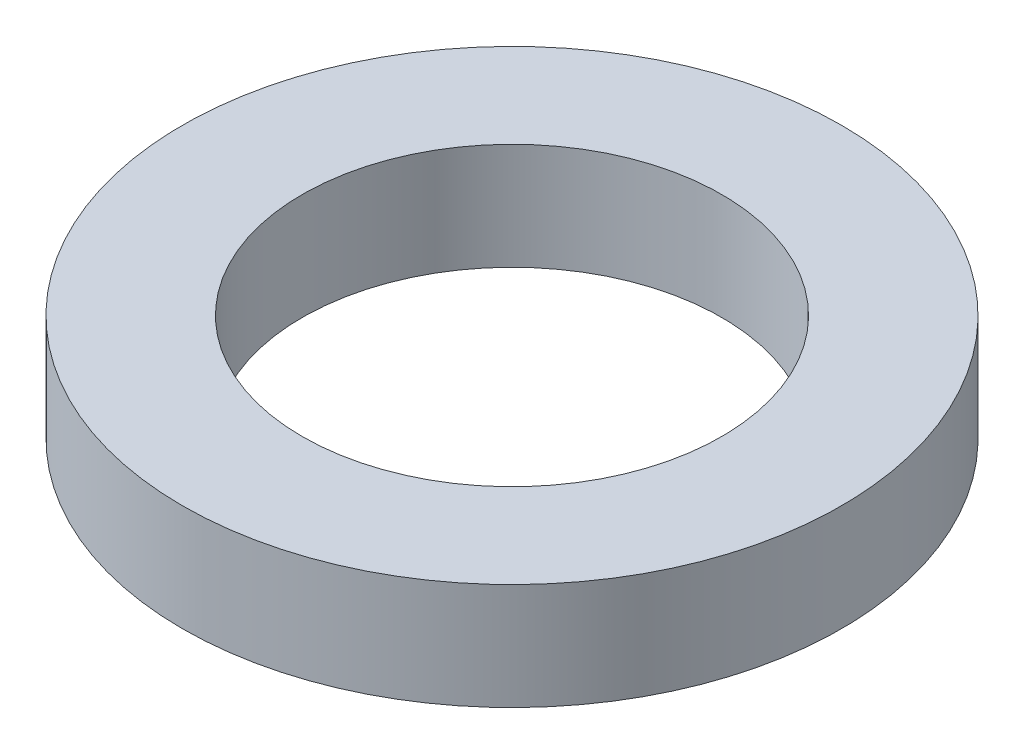
ISO-10303-21;
HEADER;
FILE_DESCRIPTION(('STEP AP214'),'2;1');
FILE_NAME('part.step','',(''),(''),'','','');
FILE_SCHEMA(('AUTOMOTIVE_DESIGN { 1 0 10303 214 1 1 1 1 }'));
ENDSEC;
DATA;
#1=APPLICATION_CONTEXT('core data for automotive mechanical design processes');
#2=APPLICATION_PROTOCOL_DEFINITION('international standard','automotive_design',2000,#1);
#3=PRODUCT_CONTEXT('',#1,'mechanical');
#4=PRODUCT('Part','Part','',(#3));
#5=PRODUCT_RELATED_PRODUCT_CATEGORY('part','',(#4));
#6=PRODUCT_DEFINITION_FORMATION('','',#4);
#7=PRODUCT_DEFINITION_CONTEXT('part definition',#1,'design');
#8=PRODUCT_DEFINITION('design','',#6,#7);
#9=PRODUCT_DEFINITION_SHAPE('','',#8);
#10=(LENGTH_UNIT() NAMED_UNIT(*) SI_UNIT(.MILLI.,.METRE.));
#11=(NAMED_UNIT(*) PLANE_ANGLE_UNIT() SI_UNIT($,.RADIAN.));
#12=(NAMED_UNIT(*) SI_UNIT($,.STERADIAN.) SOLID_ANGLE_UNIT());
#13=UNCERTAINTY_MEASURE_WITH_UNIT(LENGTH_MEASURE(1.E-05),#10,'distance_accuracy_value','');
#14=(GEOMETRIC_REPRESENTATION_CONTEXT(3) GLOBAL_UNCERTAINTY_ASSIGNED_CONTEXT((#13)) GLOBAL_UNIT_ASSIGNED_CONTEXT((#10,
#11,#12)) REPRESENTATION_CONTEXT('',''));
#15=CARTESIAN_POINT('',(0.,0.,0.));
#16=DIRECTION('',(0.,0.,1.));
#17=DIRECTION('',(1.,0.,0.));
#18=AXIS2_PLACEMENT_3D('',#15,#16,#17);
#19=CARTESIAN_POINT('',(0.,4.064,0.));
#20=DIRECTION('',(0.,1.,0.));
#21=DIRECTION('',(0.,0.,1.));
#22=AXIS2_PLACEMENT_3D('',#19,#20,#21);
#23=PLANE('',#22);
#24=CARTESIAN_POINT('',(0.,4.064,0.));
#25=DIRECTION('',(0.,1.,0.));
#26=DIRECTION('',(0.,0.,1.));
#27=AXIS2_PLACEMENT_3D('',#24,#25,#26);
#28=CIRCLE('',#27,12.573);
#29=CARTESIAN_POINT('',(0.,4.064,12.573));
#30=VERTEX_POINT('',#29);
#31=EDGE_CURVE('E10',#30,#30,#28,.T.);
#32=ORIENTED_EDGE('',*,*,#31,.T.);
#33=EDGE_LOOP('',(#32));
#34=FACE_BOUND('',#33,.T.);
#35=CARTESIAN_POINT('',(0.,4.064,0.));
#36=DIRECTION('',(0.,1.,0.));
#37=DIRECTION('',(0.,0.,1.));
#38=AXIS2_PLACEMENT_3D('',#35,#36,#37);
#39=CIRCLE('',#38,8.001);
#40=CARTESIAN_POINT('',(0.,4.064,8.001));
#41=VERTEX_POINT('',#40);
#42=EDGE_CURVE('E43',#41,#41,#39,.T.);
#43=ORIENTED_EDGE('',*,*,#42,.F.);
#44=EDGE_LOOP('',(#43));
#45=FACE_BOUND('',#44,.T.);
#46=ADVANCED_FACE('F32',(#34,#45),#23,.T.);
#47=CARTESIAN_POINT('',(0.,0.,0.));
#48=DIRECTION('',(0.,1.,0.));
#49=DIRECTION('',(0.,0.,1.));
#50=AXIS2_PLACEMENT_3D('',#47,#48,#49);
#51=PLANE('',#50);
#52=CARTESIAN_POINT('',(0.,0.,0.));
#53=DIRECTION('',(0.,1.,0.));
#54=DIRECTION('',(0.,0.,1.));
#55=AXIS2_PLACEMENT_3D('',#52,#53,#54);
#56=CIRCLE('',#55,12.573);
#57=CARTESIAN_POINT('',(0.,0.,12.573));
#58=VERTEX_POINT('',#57);
#59=EDGE_CURVE('E36',#58,#58,#56,.T.);
#60=ORIENTED_EDGE('',*,*,#59,.F.);
#61=EDGE_LOOP('',(#60));
#62=FACE_BOUND('',#61,.T.);
#63=CARTESIAN_POINT('',(0.,0.,0.));
#64=DIRECTION('',(0.,1.,0.));
#65=DIRECTION('',(0.,0.,1.));
#66=AXIS2_PLACEMENT_3D('',#63,#64,#65);
#67=CIRCLE('',#66,8.001);
#68=CARTESIAN_POINT('',(0.,0.,8.001));
#69=VERTEX_POINT('',#68);
#70=EDGE_CURVE('E45',#69,#69,#67,.T.);
#71=ORIENTED_EDGE('',*,*,#70,.T.);
#72=EDGE_LOOP('',(#71));
#73=FACE_BOUND('',#72,.T.);
#74=ADVANCED_FACE('F55',(#62,#73),#51,.F.);
#75=CARTESIAN_POINT('',(0.,4.064,0.));
#76=DIRECTION('',(0.,-1.,0.));
#77=DIRECTION('',(0.,0.,-1.));
#78=AXIS2_PLACEMENT_3D('',#75,#76,#77);
#79=CYLINDRICAL_SURFACE('',#78,12.573);
#80=ORIENTED_EDGE('',*,*,#31,.F.);
#81=EDGE_LOOP('',(#80));
#82=FACE_BOUND('',#81,.T.);
#83=ORIENTED_EDGE('',*,*,#59,.T.);
#84=EDGE_LOOP('',(#83));
#85=FACE_BOUND('',#84,.T.);
#86=ADVANCED_FACE('F34',(#82,#85),#79,.T.);
#87=CARTESIAN_POINT('',(0.,4.064,0.));
#88=DIRECTION('',(0.,-1.,0.));
#89=DIRECTION('',(0.,0.,-1.));
#90=AXIS2_PLACEMENT_3D('',#87,#88,#89);
#91=CYLINDRICAL_SURFACE('',#90,8.001);
#92=ORIENTED_EDGE('',*,*,#42,.T.);
#93=EDGE_LOOP('',(#92));
#94=FACE_BOUND('',#93,.T.);
#95=ORIENTED_EDGE('',*,*,#70,.F.);
#96=EDGE_LOOP('',(#95));
#97=FACE_BOUND('',#96,.T.);
#98=ADVANCED_FACE('F51',(#94,#97),#91,.F.);
#99=CLOSED_SHELL('',(#46,#74,#86,#98));
#100=MANIFOLD_SOLID_BREP('B2',#99);
#101=ADVANCED_BREP_SHAPE_REPRESENTATION('',(#18,#100),#14);
#102=SHAPE_DEFINITION_REPRESENTATION(#9,#101);
ENDSEC;
END-ISO-10303-21;
